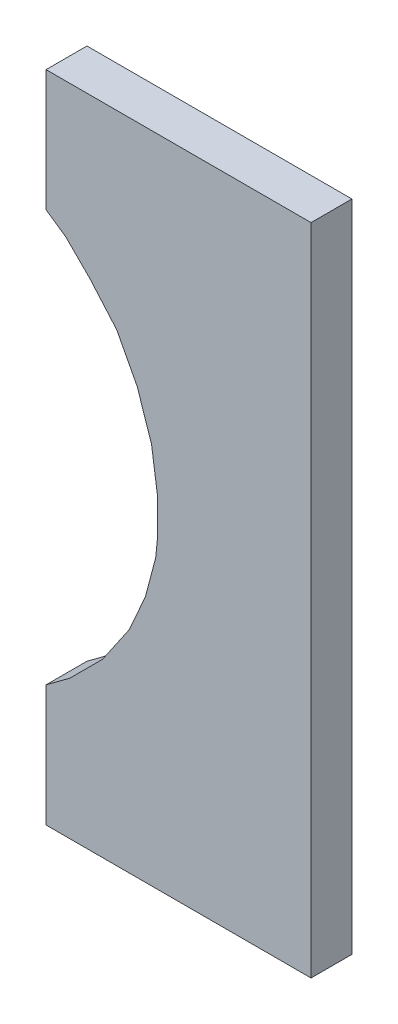
ISO-10303-21;
HEADER;
FILE_DESCRIPTION(('STEP AP214'),'2;1');
FILE_NAME('part.step','',(''),(''),'','','');
FILE_SCHEMA(('AUTOMOTIVE_DESIGN { 1 0 10303 214 1 1 1 1 }'));
ENDSEC;
DATA;
#1=APPLICATION_CONTEXT('core data for automotive mechanical design processes');
#2=APPLICATION_PROTOCOL_DEFINITION('international standard','automotive_design',2000,#1);
#3=PRODUCT_CONTEXT('',#1,'mechanical');
#4=PRODUCT('Part','Part','',(#3));
#5=PRODUCT_RELATED_PRODUCT_CATEGORY('part','',(#4));
#6=PRODUCT_DEFINITION_FORMATION('','',#4);
#7=PRODUCT_DEFINITION_CONTEXT('part definition',#1,'design');
#8=PRODUCT_DEFINITION('design','',#6,#7);
#9=PRODUCT_DEFINITION_SHAPE('','',#8);
#10=(LENGTH_UNIT() NAMED_UNIT(*) SI_UNIT(.MILLI.,.METRE.));
#11=(NAMED_UNIT(*) PLANE_ANGLE_UNIT() SI_UNIT($,.RADIAN.));
#12=(NAMED_UNIT(*) SI_UNIT($,.STERADIAN.) SOLID_ANGLE_UNIT());
#13=UNCERTAINTY_MEASURE_WITH_UNIT(LENGTH_MEASURE(1.E-05),#10,'distance_accuracy_value','');
#14=(GEOMETRIC_REPRESENTATION_CONTEXT(3) GLOBAL_UNCERTAINTY_ASSIGNED_CONTEXT((#13)) GLOBAL_UNIT_ASSIGNED_CONTEXT((#10,
#11,#12)) REPRESENTATION_CONTEXT('',''));
#15=CARTESIAN_POINT('',(0.,0.,0.));
#16=DIRECTION('',(0.,0.,1.));
#17=DIRECTION('',(1.,0.,0.));
#18=AXIS2_PLACEMENT_3D('',#15,#16,#17);
#19=CARTESIAN_POINT('',(-0.64800734,-1.00612702,0.2));
#20=DIRECTION('',(0.,0.,-1.));
#21=DIRECTION('',(-1.,0.,0.));
#22=AXIS2_PLACEMENT_3D('',#19,#20,#21);
#23=PLANE('',#22);
#24=DIRECTION('',(-1.,0.,0.));
#25=VECTOR('',#24,1.);
#26=CARTESIAN_POINT('',(-0.64800734,-1.59999934,0.2));
#27=LINE('',#26,#25);
#28=CARTESIAN_POINT('',(0.64800734,-1.59999934,0.2));
#29=VERTEX_POINT('',#28);
#30=CARTESIAN_POINT('',(-0.64800734,-1.59999934,0.2));
#31=VERTEX_POINT('',#30);
#32=EDGE_CURVE('E19',#29,#31,#27,.T.);
#33=ORIENTED_EDGE('',*,*,#32,.F.);
#34=DIRECTION('',(0.,1.,0.));
#35=VECTOR('',#34,1.);
#36=CARTESIAN_POINT('',(0.64800734,-1.59999934,0.2));
#37=LINE('',#36,#35);
#38=CARTESIAN_POINT('',(0.64800734,1.60000188,0.2));
#39=VERTEX_POINT('',#38);
#40=EDGE_CURVE('E250',#29,#39,#37,.T.);
#41=ORIENTED_EDGE('',*,*,#40,.T.);
#42=DIRECTION('',(1.,0.,0.));
#43=VECTOR('',#42,1.);
#44=CARTESIAN_POINT('',(0.64800734,1.60000188,0.2));
#45=LINE('',#44,#43);
#46=CARTESIAN_POINT('',(-0.64800734,1.60000188,0.2));
#47=VERTEX_POINT('',#46);
#48=EDGE_CURVE('E244',#39,#47,#45,.F.);
#49=ORIENTED_EDGE('',*,*,#48,.T.);
#50=DIRECTION('',(0.,1.,0.));
#51=VECTOR('',#50,1.);
#52=CARTESIAN_POINT('',(-0.64800734,1.60000188,0.2));
#53=LINE('',#52,#51);
#54=CARTESIAN_POINT('',(-0.64800734,1.00612956,0.2));
#55=VERTEX_POINT('',#54);
#56=EDGE_CURVE('E238',#47,#55,#53,.F.);
#57=ORIENTED_EDGE('',*,*,#56,.T.);
#58=DIRECTION('',(-0.823565500473163,0.567221179462112,0.));
#59=VECTOR('',#58,1.);
#60=CARTESIAN_POINT('',(-0.64800734,1.00612956,0.2));
#61=LINE('',#60,#59);
#62=CARTESIAN_POINT('',(-0.551992800000011,0.940000659999986,0.2));
#63=VERTEX_POINT('',#62);
#64=EDGE_CURVE('E232',#55,#63,#61,.F.);
#65=ORIENTED_EDGE('',*,*,#64,.T.);
#66=DIRECTION('',(-0.707106781186548,0.707106781186548,0.));
#67=VECTOR('',#66,1.);
#68=CARTESIAN_POINT('',(-0.5519928,0.94000066,0.2));
#69=LINE('',#68,#67);
#70=CARTESIAN_POINT('',(-0.43199304,0.8200009,0.2));
#71=VERTEX_POINT('',#70);
#72=EDGE_CURVE('E225',#63,#71,#69,.F.);
#73=ORIENTED_EDGE('',*,*,#72,.T.);
#74=DIRECTION('',(-0.654931512741727,0.755688238374684,0.));
#75=VECTOR('',#74,1.);
#76=CARTESIAN_POINT('',(-0.43199304,0.8200009,0.2));
#77=LINE('',#76,#75);
#78=CARTESIAN_POINT('',(-0.301993299999989,0.670001200000009,0.2));
#79=VERTEX_POINT('',#78);
#80=EDGE_CURVE('E222',#71,#79,#77,.F.);
#81=ORIENTED_EDGE('',*,*,#80,.T.);
#82=DIRECTION('',(-0.465746432832911,0.884918222381831,0.));
#83=VECTOR('',#82,1.);
#84=CARTESIAN_POINT('',(-0.3019933,0.6700012,0.2));
#85=LINE('',#84,#83);
#86=CARTESIAN_POINT('',(-0.201993499999985,0.480001580000009,0.2));
#87=VERTEX_POINT('',#86);
#88=EDGE_CURVE('E213',#79,#87,#85,.F.);
#89=ORIENTED_EDGE('',*,*,#88,.T.);
#90=DIRECTION('',(-0.316224323680056,0.948684445489169,0.));
#91=VECTOR('',#90,1.);
#92=CARTESIAN_POINT('',(-0.2019935,0.48000158,0.2));
#93=LINE('',#92,#91);
#94=CARTESIAN_POINT('',(-0.13199364000001,0.269999459999998,0.2));
#95=VERTEX_POINT('',#94);
#96=EDGE_CURVE('E207',#87,#95,#93,.F.);
#97=ORIENTED_EDGE('',*,*,#96,.T.);
#98=DIRECTION('',(-0.141421356237029,0.989949493661207,0.));
#99=VECTOR('',#98,1.);
#100=CARTESIAN_POINT('',(-0.13199364,0.26999946,0.2));
#101=LINE('',#100,#99);
#102=CARTESIAN_POINT('',(-0.101993700000015,0.05999988,0.2));
#103=VERTEX_POINT('',#102);
#104=EDGE_CURVE('E201',#95,#103,#101,.F.);
#105=ORIENTED_EDGE('',*,*,#104,.T.);
#106=DIRECTION('',(0.,1.,0.));
#107=VECTOR('',#106,1.);
#108=CARTESIAN_POINT('',(-0.1019937,0.05999988,0.2));
#109=LINE('',#108,#107);
#110=CARTESIAN_POINT('',(-0.1019937,-0.0999998,0.2));
#111=VERTEX_POINT('',#110);
#112=EDGE_CURVE('E195',#103,#111,#109,.F.);
#113=ORIENTED_EDGE('',*,*,#112,.T.);
#114=DIRECTION('',(0.0995037190209989,0.995037190209989,0.));
#115=VECTOR('',#114,1.);
#116=CARTESIAN_POINT('',(-0.1019937,-0.0999998,0.2));
#117=LINE('',#116,#115);
#118=CARTESIAN_POINT('',(-0.11199368,-0.1999996,0.2));
#119=VERTEX_POINT('',#118);
#120=EDGE_CURVE('E189',#111,#119,#117,.F.);
#121=ORIENTED_EDGE('',*,*,#120,.T.);
#122=DIRECTION('',(0.25449329927989,0.967074537262582,0.));
#123=VECTOR('',#122,1.);
#124=CARTESIAN_POINT('',(-0.11199368,-0.1999996,0.2));
#125=LINE('',#124,#123);
#126=CARTESIAN_POINT('',(-0.161993580000012,-0.389999219999996,0.2));
#127=VERTEX_POINT('',#126);
#128=EDGE_CURVE('E183',#119,#127,#125,.F.);
#129=ORIENTED_EDGE('',*,*,#128,.T.);
#130=DIRECTION('',(0.40613846605317,0.913811548620381,0.));
#131=VECTOR('',#130,1.);
#132=CARTESIAN_POINT('',(-0.16199358,-0.38999922,0.2));
#133=LINE('',#132,#131);
#134=CARTESIAN_POINT('',(-0.241993419999986,-0.569998860000005,0.2));
#135=VERTEX_POINT('',#134);
#136=EDGE_CURVE('E178',#127,#135,#133,.F.);
#137=ORIENTED_EDGE('',*,*,#136,.T.);
#138=DIRECTION('',(0.564683915591919,0.825307261249881,0.));
#139=VECTOR('',#138,1.);
#140=CARTESIAN_POINT('',(-0.24199342,-0.56999886,0.2));
#141=LINE('',#140,#139);
#142=CARTESIAN_POINT('',(-0.371993159999996,-0.759998480000003,0.2));
#143=VERTEX_POINT('',#142);
#144=EDGE_CURVE('E172',#135,#143,#141,.F.);
#145=ORIENTED_EDGE('',*,*,#144,.T.);
#146=DIRECTION('',(0.707106781186548,0.707106781186548,0.));
#147=VECTOR('',#146,1.);
#148=CARTESIAN_POINT('',(-0.37199316,-0.75999848,0.2));
#149=LINE('',#148,#147);
#150=CARTESIAN_POINT('',(-0.53199284,-0.91999816,0.2));
#151=VERTEX_POINT('',#150);
#152=EDGE_CURVE('E140',#143,#151,#149,.F.);
#153=ORIENTED_EDGE('',*,*,#152,.T.);
#154=DIRECTION('',(0.802920527365125,0.596086090037093,0.));
#155=VECTOR('',#154,1.);
#156=CARTESIAN_POINT('',(-0.53199284,-0.91999816,0.2));
#157=LINE('',#156,#155);
#158=CARTESIAN_POINT('',(-0.648007339999993,-1.00612702000001,0.2));
#159=VERTEX_POINT('',#158);
#160=EDGE_CURVE('E157',#151,#159,#157,.F.);
#161=ORIENTED_EDGE('',*,*,#160,.T.);
#162=DIRECTION('',(0.,1.,0.));
#163=VECTOR('',#162,1.);
#164=CARTESIAN_POINT('',(-0.64800734,-1.00612702,0.2));
#165=LINE('',#164,#163);
#166=EDGE_CURVE('E148',#31,#159,#165,.T.);
#167=ORIENTED_EDGE('',*,*,#166,.F.);
#168=EDGE_LOOP('',(#33,#41,#49,#57,#65,#73,#81,#89,#97,#105,#113,#121,#129,#137,#145,#153,#161,#167));
#169=FACE_BOUND('',#168,.T.);
#170=ADVANCED_FACE('F16',(#169),#23,.F.);
#171=CARTESIAN_POINT('',(-0.53199284,-0.91999816,0.));
#172=DIRECTION('',(0.596086090037093,-0.802920527365125,0.));
#173=DIRECTION('',(0.802920527365125,0.596086090037093,0.));
#174=AXIS2_PLACEMENT_3D('',#171,#172,#173);
#175=PLANE('',#174);
#176=DIRECTION('',(0.,0.,-1.));
#177=VECTOR('',#176,1.);
#178=CARTESIAN_POINT('',(-0.64800734,-1.00612702,0.));
#179=LINE('',#178,#177);
#180=CARTESIAN_POINT('',(-0.648007339999985,-1.00612702000002,0.));
#181=VERTEX_POINT('',#180);
#182=EDGE_CURVE('E155',#181,#159,#179,.F.);
#183=ORIENTED_EDGE('',*,*,#182,.T.);
#184=ORIENTED_EDGE('',*,*,#160,.F.);
#185=DIRECTION('',(0.,0.,1.));
#186=VECTOR('',#185,1.);
#187=CARTESIAN_POINT('',(-0.53199284,-0.91999816,0.));
#188=LINE('',#187,#186);
#189=CARTESIAN_POINT('',(-0.53199284,-0.91999816,0.));
#190=VERTEX_POINT('',#189);
#191=EDGE_CURVE('E169',#151,#190,#188,.F.);
#192=ORIENTED_EDGE('',*,*,#191,.T.);
#193=DIRECTION('',(0.802920527365337,0.596086090036808,0.));
#194=VECTOR('',#193,1.);
#195=CARTESIAN_POINT('',(-0.64800734,-1.00612702,0.));
#196=LINE('',#195,#194);
#197=EDGE_CURVE('E154',#181,#190,#196,.T.);
#198=ORIENTED_EDGE('',*,*,#197,.F.);
#199=EDGE_LOOP('',(#183,#184,#192,#198));
#200=FACE_BOUND('',#199,.T.);
#201=ADVANCED_FACE('F399',(#200),#175,.F.);
#202=CARTESIAN_POINT('',(-0.37199316,-0.75999848,0.));
#203=DIRECTION('',(0.707106781186548,-0.707106781186548,0.));
#204=DIRECTION('',(0.707106781186548,0.707106781186548,0.));
#205=AXIS2_PLACEMENT_3D('',#202,#203,#204);
#206=PLANE('',#205);
#207=ORIENTED_EDGE('',*,*,#191,.F.);
#208=ORIENTED_EDGE('',*,*,#152,.F.);
#209=DIRECTION('',(0.,0.,1.));
#210=VECTOR('',#209,1.);
#211=CARTESIAN_POINT('',(-0.371993159999984,-0.759998480000011,0.));
#212=LINE('',#211,#210);
#213=CARTESIAN_POINT('',(-0.371993159999996,-0.759998480000003,0.));
#214=VERTEX_POINT('',#213);
#215=EDGE_CURVE('E175',#143,#214,#212,.F.);
#216=ORIENTED_EDGE('',*,*,#215,.T.);
#217=DIRECTION('',(0.707106781186548,0.707106781186547,0.));
#218=VECTOR('',#217,1.);
#219=CARTESIAN_POINT('',(-0.53199284,-0.91999816,0.));
#220=LINE('',#219,#218);
#221=EDGE_CURVE('E263',#190,#214,#220,.T.);
#222=ORIENTED_EDGE('',*,*,#221,.F.);
#223=EDGE_LOOP('',(#207,#208,#216,#222));
#224=FACE_BOUND('',#223,.T.);
#225=ADVANCED_FACE('F397',(#224),#206,.F.);
#226=CARTESIAN_POINT('',(-0.24199342,-0.56999886,0.));
#227=DIRECTION('',(0.825307261249881,-0.564683915591919,0.));
#228=DIRECTION('',(0.564683915591919,0.825307261249881,0.));
#229=AXIS2_PLACEMENT_3D('',#226,#227,#228);
#230=PLANE('',#229);
#231=ORIENTED_EDGE('',*,*,#215,.F.);
#232=ORIENTED_EDGE('',*,*,#144,.F.);
#233=DIRECTION('',(0.,0.,1.));
#234=VECTOR('',#233,1.);
#235=CARTESIAN_POINT('',(-0.241993419999945,-0.569998860000024,0.));
#236=LINE('',#235,#234);
#237=CARTESIAN_POINT('',(-0.241993419999986,-0.569998860000006,0.));
#238=VERTEX_POINT('',#237);
#239=EDGE_CURVE('E181',#135,#238,#236,.F.);
#240=ORIENTED_EDGE('',*,*,#239,.T.);
#241=DIRECTION('',(0.56468391559199,0.825307261249832,0.));
#242=VECTOR('',#241,1.);
#243=CARTESIAN_POINT('',(-0.37199316,-0.75999848,0.));
#244=LINE('',#243,#242);
#245=EDGE_CURVE('E267',#214,#238,#244,.T.);
#246=ORIENTED_EDGE('',*,*,#245,.F.);
#247=EDGE_LOOP('',(#231,#232,#240,#246));
#248=FACE_BOUND('',#247,.T.);
#249=ADVANCED_FACE('F392',(#248),#230,.F.);
#250=CARTESIAN_POINT('',(-0.16199358,-0.38999922,0.));
#251=DIRECTION('',(0.913811548620381,-0.40613846605317,0.));
#252=DIRECTION('',(0.40613846605317,0.913811548620381,0.));
#253=AXIS2_PLACEMENT_3D('',#250,#251,#252);
#254=PLANE('',#253);
#255=ORIENTED_EDGE('',*,*,#239,.F.);
#256=ORIENTED_EDGE('',*,*,#136,.F.);
#257=DIRECTION('',(0.,0.,1.));
#258=VECTOR('',#257,1.);
#259=CARTESIAN_POINT('',(-0.161993580000048,-0.389999219999987,0.));
#260=LINE('',#259,#258);
#261=CARTESIAN_POINT('',(-0.161993580000012,-0.389999219999997,0.));
#262=VERTEX_POINT('',#261);
#263=EDGE_CURVE('E186',#127,#262,#260,.F.);
#264=ORIENTED_EDGE('',*,*,#263,.T.);
#265=DIRECTION('',(0.406138466053447,0.913811548620257,0.));
#266=VECTOR('',#265,1.);
#267=CARTESIAN_POINT('',(-0.24199342,-0.56999886,0.));
#268=LINE('',#267,#266);
#269=EDGE_CURVE('E271',#238,#262,#268,.T.);
#270=ORIENTED_EDGE('',*,*,#269,.F.);
#271=EDGE_LOOP('',(#255,#256,#264,#270));
#272=FACE_BOUND('',#271,.T.);
#273=ADVANCED_FACE('F388',(#272),#254,.F.);
#274=CARTESIAN_POINT('',(-0.11199368,-0.1999996,0.));
#275=DIRECTION('',(0.967074537262582,-0.25449329927989,0.));
#276=DIRECTION('',(0.25449329927989,0.967074537262582,0.));
#277=AXIS2_PLACEMENT_3D('',#274,#275,#276);
#278=PLANE('',#277);
#279=ORIENTED_EDGE('',*,*,#263,.F.);
#280=ORIENTED_EDGE('',*,*,#128,.F.);
#281=DIRECTION('',(0.,0.,1.));
#282=VECTOR('',#281,1.);
#283=CARTESIAN_POINT('',(-0.11199368,-0.1999996,0.));
#284=LINE('',#283,#282);
#285=CARTESIAN_POINT('',(-0.11199368,-0.1999996,0.));
#286=VERTEX_POINT('',#285);
#287=EDGE_CURVE('E192',#119,#286,#284,.F.);
#288=ORIENTED_EDGE('',*,*,#287,.T.);
#289=DIRECTION('',(0.254493299279643,0.967074537262646,0.));
#290=VECTOR('',#289,1.);
#291=CARTESIAN_POINT('',(-0.16199358,-0.38999922,0.));
#292=LINE('',#291,#290);
#293=EDGE_CURVE('E275',#262,#286,#292,.T.);
#294=ORIENTED_EDGE('',*,*,#293,.F.);
#295=EDGE_LOOP('',(#279,#280,#288,#294));
#296=FACE_BOUND('',#295,.T.);
#297=ADVANCED_FACE('F383',(#296),#278,.F.);
#298=CARTESIAN_POINT('',(-0.1019937,-0.0999998,0.));
#299=DIRECTION('',(0.995037190209989,-0.0995037190209989,0.));
#300=DIRECTION('',(0.0995037190209989,0.995037190209989,0.));
#301=AXIS2_PLACEMENT_3D('',#298,#299,#300);
#302=PLANE('',#301);
#303=ORIENTED_EDGE('',*,*,#287,.F.);
#304=ORIENTED_EDGE('',*,*,#120,.F.);
#305=DIRECTION('',(0.,0.,-1.));
#306=VECTOR('',#305,1.);
#307=CARTESIAN_POINT('',(-0.1019937,-0.0999998,0.));
#308=LINE('',#307,#306);
#309=CARTESIAN_POINT('',(-0.1019937,-0.0999998,0.));
#310=VERTEX_POINT('',#309);
#311=EDGE_CURVE('E198',#111,#310,#308,.T.);
#312=ORIENTED_EDGE('',*,*,#311,.T.);
#313=DIRECTION('',(0.0995037190209989,0.995037190209989,0.));
#314=VECTOR('',#313,1.);
#315=CARTESIAN_POINT('',(-0.11199368,-0.1999996,0.));
#316=LINE('',#315,#314);
#317=EDGE_CURVE('E279',#286,#310,#316,.T.);
#318=ORIENTED_EDGE('',*,*,#317,.F.);
#319=EDGE_LOOP('',(#303,#304,#312,#318));
#320=FACE_BOUND('',#319,.T.);
#321=ADVANCED_FACE('F378',(#320),#302,.F.);
#322=CARTESIAN_POINT('',(-0.1019937,0.05999988,0.));
#323=DIRECTION('',(1.,0.,0.));
#324=DIRECTION('',(0.,0.,-1.));
#325=AXIS2_PLACEMENT_3D('',#322,#323,#324);
#326=PLANE('',#325);
#327=ORIENTED_EDGE('',*,*,#311,.F.);
#328=ORIENTED_EDGE('',*,*,#112,.F.);
#329=DIRECTION('',(0.,0.,1.));
#330=VECTOR('',#329,1.);
#331=CARTESIAN_POINT('',(-0.101993700000059,0.0599998799999915,0.));
#332=LINE('',#331,#330);
#333=CARTESIAN_POINT('',(-0.101993700000015,0.059999879999999,0.));
#334=VERTEX_POINT('',#333);
#335=EDGE_CURVE('E204',#103,#334,#332,.F.);
#336=ORIENTED_EDGE('',*,*,#335,.T.);
#337=DIRECTION('',(0.,1.,0.));
#338=VECTOR('',#337,1.);
#339=CARTESIAN_POINT('',(-0.1019937,-1.00612702,0.));
#340=LINE('',#339,#338);
#341=EDGE_CURVE('E283',#310,#334,#340,.T.);
#342=ORIENTED_EDGE('',*,*,#341,.F.);
#343=EDGE_LOOP('',(#327,#328,#336,#342));
#344=FACE_BOUND('',#343,.T.);
#345=ADVANCED_FACE('F373',(#344),#326,.F.);
#346=CARTESIAN_POINT('',(-0.13199364,0.26999946,0.));
#347=DIRECTION('',(0.989949493661207,0.141421356237029,0.));
#348=DIRECTION('',(-0.141421356237029,0.989949493661207,0.));
#349=AXIS2_PLACEMENT_3D('',#346,#347,#348);
#350=PLANE('',#349);
#351=ORIENTED_EDGE('',*,*,#335,.F.);
#352=ORIENTED_EDGE('',*,*,#104,.F.);
#353=DIRECTION('',(0.,0.,1.));
#354=VECTOR('',#353,1.);
#355=CARTESIAN_POINT('',(-0.131993640000039,0.269999459999987,0.));
#356=LINE('',#355,#354);
#357=CARTESIAN_POINT('',(-0.13199364000001,0.269999459999997,0.));
#358=VERTEX_POINT('',#357);
#359=EDGE_CURVE('E210',#95,#358,#356,.F.);
#360=ORIENTED_EDGE('',*,*,#359,.T.);
#361=DIRECTION('',(-0.141421356237309,0.989949493661167,0.));
#362=VECTOR('',#361,1.);
#363=CARTESIAN_POINT('',(-0.1019937,0.05999988,0.));
#364=LINE('',#363,#362);
#365=EDGE_CURVE('E287',#334,#358,#364,.T.);
#366=ORIENTED_EDGE('',*,*,#365,.F.);
#367=EDGE_LOOP('',(#351,#352,#360,#366));
#368=FACE_BOUND('',#367,.T.);
#369=ADVANCED_FACE('F368',(#368),#350,.F.);
#370=CARTESIAN_POINT('',(-0.2019935,0.48000158,0.));
#371=DIRECTION('',(0.948684445489169,0.316224323680056,0.));
#372=DIRECTION('',(-0.316224323680056,0.948684445489169,0.));
#373=AXIS2_PLACEMENT_3D('',#370,#371,#372);
#374=PLANE('',#373);
#375=ORIENTED_EDGE('',*,*,#359,.F.);
#376=ORIENTED_EDGE('',*,*,#96,.F.);
#377=DIRECTION('',(0.,0.,1.));
#378=VECTOR('',#377,1.);
#379=CARTESIAN_POINT('',(-0.201993499999938,0.480001580000033,0.));
#380=LINE('',#379,#378);
#381=CARTESIAN_POINT('',(-0.201993499999985,0.480001580000008,0.));
#382=VERTEX_POINT('',#381);
#383=EDGE_CURVE('E216',#87,#382,#380,.F.);
#384=ORIENTED_EDGE('',*,*,#383,.T.);
#385=DIRECTION('',(-0.316224323680234,0.948684445489109,0.));
#386=VECTOR('',#385,1.);
#387=CARTESIAN_POINT('',(-0.13199364,0.26999946,0.));
#388=LINE('',#387,#386);
#389=EDGE_CURVE('E291',#358,#382,#388,.T.);
#390=ORIENTED_EDGE('',*,*,#389,.F.);
#391=EDGE_LOOP('',(#375,#376,#384,#390));
#392=FACE_BOUND('',#391,.T.);
#393=ADVANCED_FACE('F363',(#392),#374,.F.);
#394=CARTESIAN_POINT('',(-0.3019933,0.6700012,0.));
#395=DIRECTION('',(0.884918222381831,0.465746432832911,0.));
#396=DIRECTION('',(-0.465746432832911,0.884918222381831,0.));
#397=AXIS2_PLACEMENT_3D('',#394,#395,#396);
#398=PLANE('',#397);
#399=ORIENTED_EDGE('',*,*,#383,.F.);
#400=ORIENTED_EDGE('',*,*,#88,.F.);
#401=DIRECTION('',(0.,0.,1.));
#402=VECTOR('',#401,1.);
#403=CARTESIAN_POINT('',(-0.301993299999957,0.670001200000038,0.));
#404=LINE('',#403,#402);
#405=CARTESIAN_POINT('',(-0.301993299999989,0.670001200000009,0.));
#406=VERTEX_POINT('',#405);
#407=EDGE_CURVE('E219',#79,#406,#404,.F.);
#408=ORIENTED_EDGE('',*,*,#407,.T.);
#409=DIRECTION('',(-0.465746432832622,0.884918222381982,0.));
#410=VECTOR('',#409,1.);
#411=CARTESIAN_POINT('',(-0.2019935,0.48000158,0.));
#412=LINE('',#411,#410);
#413=EDGE_CURVE('E295',#382,#406,#412,.T.);
#414=ORIENTED_EDGE('',*,*,#413,.F.);
#415=EDGE_LOOP('',(#399,#400,#408,#414));
#416=FACE_BOUND('',#415,.T.);
#417=ADVANCED_FACE('F358',(#416),#398,.F.);
#418=CARTESIAN_POINT('',(-0.43199304,0.8200009,0.));
#419=DIRECTION('',(0.755688238374684,0.654931512741727,0.));
#420=DIRECTION('',(-0.654931512741727,0.755688238374684,0.));
#421=AXIS2_PLACEMENT_3D('',#418,#419,#420);
#422=PLANE('',#421);
#423=DIRECTION('',(0.,0.,1.));
#424=VECTOR('',#423,1.);
#425=CARTESIAN_POINT('',(-0.43199304,0.8200009,0.));
#426=LINE('',#425,#424);
#427=CARTESIAN_POINT('',(-0.43199304,0.8200009,0.));
#428=VERTEX_POINT('',#427);
#429=EDGE_CURVE('E228',#71,#428,#426,.F.);
#430=ORIENTED_EDGE('',*,*,#429,.T.);
#431=DIRECTION('',(-0.654929564057522,0.755689927234328,0.));
#432=VECTOR('',#431,1.);
#433=CARTESIAN_POINT('',(-0.3019933,0.6700012,0.));
#434=LINE('',#433,#432);
#435=EDGE_CURVE('E299',#406,#428,#434,.T.);
#436=ORIENTED_EDGE('',*,*,#435,.F.);
#437=ORIENTED_EDGE('',*,*,#407,.F.);
#438=ORIENTED_EDGE('',*,*,#80,.F.);
#439=EDGE_LOOP('',(#430,#436,#437,#438));
#440=FACE_BOUND('',#439,.T.);
#441=ADVANCED_FACE('F353',(#440),#422,.F.);
#442=CARTESIAN_POINT('',(-0.5519928,0.94000066,0.));
#443=DIRECTION('',(0.707106781186548,0.707106781186548,0.));
#444=DIRECTION('',(-0.707106781186548,0.707106781186548,0.));
#445=AXIS2_PLACEMENT_3D('',#442,#443,#444);
#446=PLANE('',#445);
#447=ORIENTED_EDGE('',*,*,#429,.F.);
#448=ORIENTED_EDGE('',*,*,#72,.F.);
#449=DIRECTION('',(0.,0.,1.));
#450=VECTOR('',#449,1.);
#451=CARTESIAN_POINT('',(-0.551992800000041,0.94000065999994,0.));
#452=LINE('',#451,#450);
#453=CARTESIAN_POINT('',(-0.551992800000011,0.940000659999985,0.));
#454=VERTEX_POINT('',#453);
#455=EDGE_CURVE('E235',#63,#454,#452,.F.);
#456=ORIENTED_EDGE('',*,*,#455,.T.);
#457=DIRECTION('',(-0.707106781186548,0.707106781186547,0.));
#458=VECTOR('',#457,1.);
#459=CARTESIAN_POINT('',(-0.43199304,0.8200009,0.));
#460=LINE('',#459,#458);
#461=EDGE_CURVE('E302',#428,#454,#460,.T.);
#462=ORIENTED_EDGE('',*,*,#461,.F.);
#463=EDGE_LOOP('',(#447,#448,#456,#462));
#464=FACE_BOUND('',#463,.T.);
#465=ADVANCED_FACE('F348',(#464),#446,.F.);
#466=CARTESIAN_POINT('',(-0.64800734,1.00612956,0.));
#467=DIRECTION('',(0.567221179462112,0.823565500473163,0.));
#468=DIRECTION('',(-0.823565500473163,0.567221179462112,0.));
#469=AXIS2_PLACEMENT_3D('',#466,#467,#468);
#470=PLANE('',#469);
#471=ORIENTED_EDGE('',*,*,#455,.F.);
#472=ORIENTED_EDGE('',*,*,#64,.F.);
#473=DIRECTION('',(0.,0.,-1.));
#474=VECTOR('',#473,1.);
#475=CARTESIAN_POINT('',(-0.64800734,1.00612956,0.));
#476=LINE('',#475,#474);
#477=CARTESIAN_POINT('',(-0.64800734,1.00612956,0.));
#478=VERTEX_POINT('',#477);
#479=EDGE_CURVE('E241',#55,#478,#476,.T.);
#480=ORIENTED_EDGE('',*,*,#479,.T.);
#481=DIRECTION('',(-0.823565500473516,0.567221179461599,0.));
#482=VECTOR('',#481,1.);
#483=CARTESIAN_POINT('',(-0.5519928,0.94000066,0.));
#484=LINE('',#483,#482);
#485=EDGE_CURVE('E306',#454,#478,#484,.T.);
#486=ORIENTED_EDGE('',*,*,#485,.F.);
#487=EDGE_LOOP('',(#471,#472,#480,#486));
#488=FACE_BOUND('',#487,.T.);
#489=ADVANCED_FACE('F343',(#488),#470,.F.);
#490=CARTESIAN_POINT('',(-0.64800734,1.60000188,0.));
#491=DIRECTION('',(1.,0.,0.));
#492=DIRECTION('',(0.,0.,-1.));
#493=AXIS2_PLACEMENT_3D('',#490,#491,#492);
#494=PLANE('',#493);
#495=ORIENTED_EDGE('',*,*,#479,.F.);
#496=ORIENTED_EDGE('',*,*,#56,.F.);
#497=DIRECTION('',(0.,0.,-1.));
#498=VECTOR('',#497,1.);
#499=CARTESIAN_POINT('',(-0.64800734,1.60000188,0.));
#500=LINE('',#499,#498);
#501=CARTESIAN_POINT('',(-0.64800734,1.60000188,0.));
#502=VERTEX_POINT('',#501);
#503=EDGE_CURVE('E247',#47,#502,#500,.T.);
#504=ORIENTED_EDGE('',*,*,#503,.T.);
#505=DIRECTION('',(0.,1.,0.));
#506=VECTOR('',#505,1.);
#507=CARTESIAN_POINT('',(-0.64800734,-1.00612702,0.));
#508=LINE('',#507,#506);
#509=EDGE_CURVE('E310',#478,#502,#508,.T.);
#510=ORIENTED_EDGE('',*,*,#509,.F.);
#511=EDGE_LOOP('',(#495,#496,#504,#510));
#512=FACE_BOUND('',#511,.T.);
#513=ADVANCED_FACE('F338',(#512),#494,.F.);
#514=CARTESIAN_POINT('',(0.64800734,1.60000188,0.));
#515=DIRECTION('',(0.,-1.,0.));
#516=DIRECTION('',(0.,0.,-1.));
#517=AXIS2_PLACEMENT_3D('',#514,#515,#516);
#518=PLANE('',#517);
#519=ORIENTED_EDGE('',*,*,#503,.F.);
#520=ORIENTED_EDGE('',*,*,#48,.F.);
#521=DIRECTION('',(0.,0.,1.));
#522=VECTOR('',#521,1.);
#523=CARTESIAN_POINT('',(0.64800734,1.60000188,0.));
#524=LINE('',#523,#522);
#525=CARTESIAN_POINT('',(0.64800734,1.60000188,0.));
#526=VERTEX_POINT('',#525);
#527=EDGE_CURVE('E253',#39,#526,#524,.F.);
#528=ORIENTED_EDGE('',*,*,#527,.T.);
#529=DIRECTION('',(-1.,0.,0.));
#530=VECTOR('',#529,1.);
#531=CARTESIAN_POINT('',(-0.64800734,1.60000188,0.));
#532=LINE('',#531,#530);
#533=EDGE_CURVE('E314',#502,#526,#532,.F.);
#534=ORIENTED_EDGE('',*,*,#533,.F.);
#535=EDGE_LOOP('',(#519,#520,#528,#534));
#536=FACE_BOUND('',#535,.T.);
#537=ADVANCED_FACE('F334',(#536),#518,.F.);
#538=CARTESIAN_POINT('',(0.64800734,-1.59999934,0.));
#539=DIRECTION('',(-1.,0.,0.));
#540=DIRECTION('',(0.,0.,1.));
#541=AXIS2_PLACEMENT_3D('',#538,#539,#540);
#542=PLANE('',#541);
#543=ORIENTED_EDGE('',*,*,#527,.F.);
#544=ORIENTED_EDGE('',*,*,#40,.F.);
#545=DIRECTION('',(0.,0.,1.));
#546=VECTOR('',#545,1.);
#547=CARTESIAN_POINT('',(0.64800734,-1.59999934,0.));
#548=LINE('',#547,#546);
#549=CARTESIAN_POINT('',(0.64800734,-1.59999934,0.));
#550=VERTEX_POINT('',#549);
#551=EDGE_CURVE('E144',#29,#550,#548,.F.);
#552=ORIENTED_EDGE('',*,*,#551,.T.);
#553=DIRECTION('',(0.,1.,0.));
#554=VECTOR('',#553,1.);
#555=CARTESIAN_POINT('',(0.64800734,-1.00612702,0.));
#556=LINE('',#555,#554);
#557=EDGE_CURVE('E317',#526,#550,#556,.F.);
#558=ORIENTED_EDGE('',*,*,#557,.F.);
#559=EDGE_LOOP('',(#543,#544,#552,#558));
#560=FACE_BOUND('',#559,.T.);
#561=ADVANCED_FACE('F329',(#560),#542,.F.);
#562=CARTESIAN_POINT('',(-0.64800734,-1.59999934,0.));
#563=DIRECTION('',(0.,1.,0.));
#564=DIRECTION('',(0.,0.,1.));
#565=AXIS2_PLACEMENT_3D('',#562,#563,#564);
#566=PLANE('',#565);
#567=ORIENTED_EDGE('',*,*,#551,.F.);
#568=ORIENTED_EDGE('',*,*,#32,.T.);
#569=DIRECTION('',(0.,0.,-1.));
#570=VECTOR('',#569,1.);
#571=CARTESIAN_POINT('',(-0.64800734,-1.59999934,0.));
#572=LINE('',#571,#570);
#573=CARTESIAN_POINT('',(-0.64800734,-1.59999934,0.));
#574=VERTEX_POINT('',#573);
#575=EDGE_CURVE('E35',#31,#574,#572,.T.);
#576=ORIENTED_EDGE('',*,*,#575,.T.);
#577=DIRECTION('',(-1.,0.,0.));
#578=VECTOR('',#577,1.);
#579=CARTESIAN_POINT('',(-0.64800734,-1.59999934,0.));
#580=LINE('',#579,#578);
#581=EDGE_CURVE('E26',#550,#574,#580,.T.);
#582=ORIENTED_EDGE('',*,*,#581,.F.);
#583=EDGE_LOOP('',(#567,#568,#576,#582));
#584=FACE_BOUND('',#583,.T.);
#585=ADVANCED_FACE('F143',(#584),#566,.F.);
#586=CARTESIAN_POINT('',(-0.64800734,-1.00612702,0.));
#587=DIRECTION('',(1.,0.,0.));
#588=DIRECTION('',(0.,0.,-1.));
#589=AXIS2_PLACEMENT_3D('',#586,#587,#588);
#590=PLANE('',#589);
#591=ORIENTED_EDGE('',*,*,#575,.F.);
#592=ORIENTED_EDGE('',*,*,#166,.T.);
#593=ORIENTED_EDGE('',*,*,#182,.F.);
#594=DIRECTION('',(0.,1.,0.));
#595=VECTOR('',#594,1.);
#596=CARTESIAN_POINT('',(-0.64800734,-1.00612702,0.));
#597=LINE('',#596,#595);
#598=EDGE_CURVE('E11',#574,#181,#597,.T.);
#599=ORIENTED_EDGE('',*,*,#598,.F.);
#600=EDGE_LOOP('',(#591,#592,#593,#599));
#601=FACE_BOUND('',#600,.T.);
#602=ADVANCED_FACE('F150',(#601),#590,.F.);
#603=CARTESIAN_POINT('',(-0.64800734,-1.00612702,0.));
#604=DIRECTION('',(0.,0.,-1.));
#605=DIRECTION('',(-1.,0.,0.));
#606=AXIS2_PLACEMENT_3D('',#603,#604,#605);
#607=PLANE('',#606);
#608=ORIENTED_EDGE('',*,*,#581,.T.);
#609=ORIENTED_EDGE('',*,*,#598,.T.);
#610=ORIENTED_EDGE('',*,*,#197,.T.);
#611=ORIENTED_EDGE('',*,*,#221,.T.);
#612=ORIENTED_EDGE('',*,*,#245,.T.);
#613=ORIENTED_EDGE('',*,*,#269,.T.);
#614=ORIENTED_EDGE('',*,*,#293,.T.);
#615=ORIENTED_EDGE('',*,*,#317,.T.);
#616=ORIENTED_EDGE('',*,*,#341,.T.);
#617=ORIENTED_EDGE('',*,*,#365,.T.);
#618=ORIENTED_EDGE('',*,*,#389,.T.);
#619=ORIENTED_EDGE('',*,*,#413,.T.);
#620=ORIENTED_EDGE('',*,*,#435,.T.);
#621=ORIENTED_EDGE('',*,*,#461,.T.);
#622=ORIENTED_EDGE('',*,*,#485,.T.);
#623=ORIENTED_EDGE('',*,*,#509,.T.);
#624=ORIENTED_EDGE('',*,*,#533,.T.);
#625=ORIENTED_EDGE('',*,*,#557,.T.);
#626=EDGE_LOOP('',(#608,#609,#610,#611,#612,#613,#614,#615,#616,#617,#618,#619,#620,#621,#622,
#623,#624,#625));
#627=FACE_BOUND('',#626,.T.);
#628=ADVANCED_FACE('F324',(#627),#607,.T.);
#629=CLOSED_SHELL('',(#170,#201,#225,#249,#273,#297,#321,#345,#369,#393,#417,#441,#465,#489,
#513,#537,#561,#585,#602,#628));
#630=MANIFOLD_SOLID_BREP('B1',#629);
#631=ADVANCED_BREP_SHAPE_REPRESENTATION('',(#18,#630),#14);
#632=SHAPE_DEFINITION_REPRESENTATION(#9,#631);
ENDSEC;
END-ISO-10303-21;
